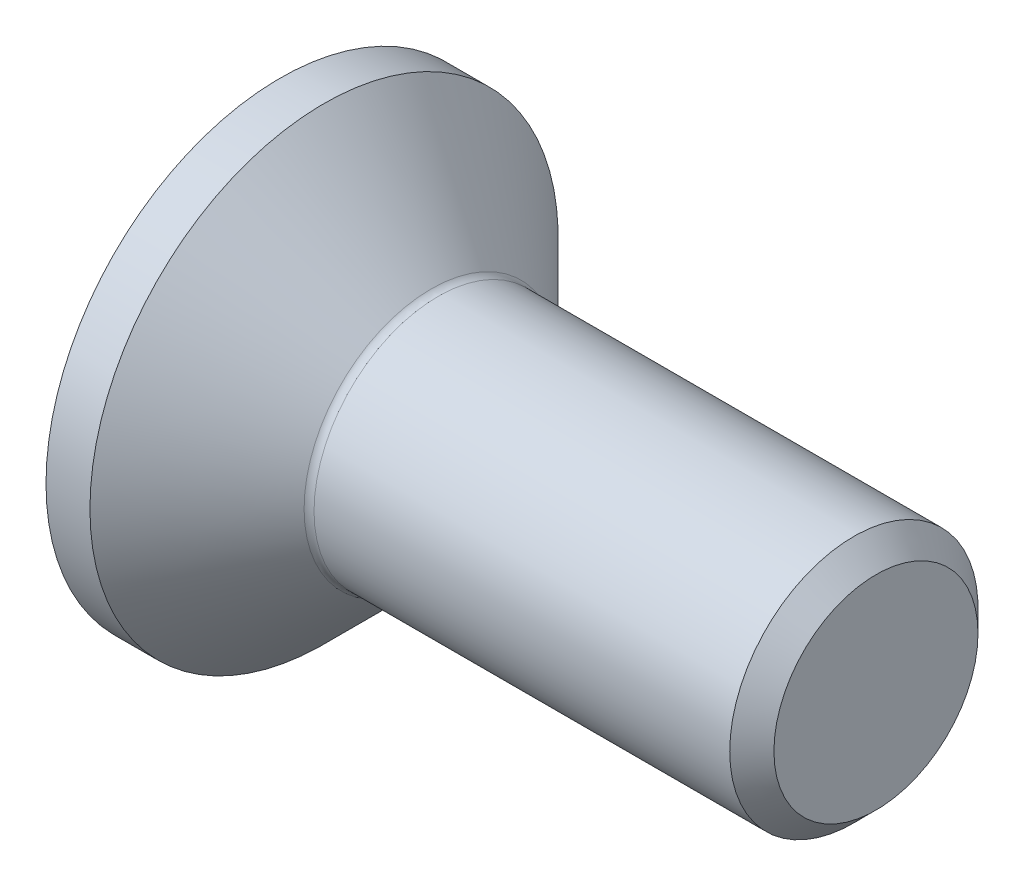
ISO-10303-21;
HEADER;
FILE_DESCRIPTION(('STEP AP214'),'2;1');
FILE_NAME('part.step','',(''),(''),'','','');
FILE_SCHEMA(('AUTOMOTIVE_DESIGN { 1 0 10303 214 1 1 1 1 }'));
ENDSEC;
DATA;
#1=APPLICATION_CONTEXT('core data for automotive mechanical design processes');
#2=APPLICATION_PROTOCOL_DEFINITION('international standard','automotive_design',2000,#1);
#3=PRODUCT_CONTEXT('',#1,'mechanical');
#4=PRODUCT('Part','Part','',(#3));
#5=PRODUCT_RELATED_PRODUCT_CATEGORY('part','',(#4));
#6=PRODUCT_DEFINITION_FORMATION('','',#4);
#7=PRODUCT_DEFINITION_CONTEXT('part definition',#1,'design');
#8=PRODUCT_DEFINITION('design','',#6,#7);
#9=PRODUCT_DEFINITION_SHAPE('','',#8);
#10=(LENGTH_UNIT() NAMED_UNIT(*) SI_UNIT(.MILLI.,.METRE.));
#11=(NAMED_UNIT(*) PLANE_ANGLE_UNIT() SI_UNIT($,.RADIAN.));
#12=(NAMED_UNIT(*) SI_UNIT($,.STERADIAN.) SOLID_ANGLE_UNIT());
#13=UNCERTAINTY_MEASURE_WITH_UNIT(LENGTH_MEASURE(1.E-05),#10,'distance_accuracy_value','');
#14=(GEOMETRIC_REPRESENTATION_CONTEXT(3) GLOBAL_UNCERTAINTY_ASSIGNED_CONTEXT((#13)) GLOBAL_UNIT_ASSIGNED_CONTEXT((#10,
#11,#12)) REPRESENTATION_CONTEXT('',''));
#15=CARTESIAN_POINT('',(0.,0.,0.));
#16=DIRECTION('',(0.,0.,1.));
#17=DIRECTION('',(1.,0.,0.));
#18=AXIS2_PLACEMENT_3D('',#15,#16,#17);
#19=CARTESIAN_POINT('',(0.,0.,0.));
#20=DIRECTION('',(-1.,0.,0.));
#21=DIRECTION('',(0.,0.,1.));
#22=AXIS2_PLACEMENT_3D('',#19,#20,#21);
#23=PLANE('',#22);
#24=CARTESIAN_POINT('',(0.,0.,0.));
#25=DIRECTION('',(-1.,0.,0.));
#26=DIRECTION('',(0.,0.,1.));
#27=AXIS2_PLACEMENT_3D('',#24,#25,#26);
#28=CIRCLE('',#27,4.715);
#29=CARTESIAN_POINT('',(0.,0.,4.715));
#30=VERTEX_POINT('',#29);
#31=EDGE_CURVE('E153',#30,#30,#28,.T.);
#32=ORIENTED_EDGE('',*,*,#31,.T.);
#33=EDGE_LOOP('',(#32));
#34=FACE_BOUND('',#33,.T.);
#35=DIRECTION('',(0.,-0.499999999999999,-0.866025403784439));
#36=VECTOR('',#35,1.);
#37=CARTESIAN_POINT('',(0.,-0.866025403784438,1.5));
#38=LINE('',#37,#36);
#39=CARTESIAN_POINT('',(0.,-0.866025403784438,1.5));
#40=VERTEX_POINT('',#39);
#41=CARTESIAN_POINT('',(0.,-1.73205080756887,0.));
#42=VERTEX_POINT('',#41);
#43=EDGE_CURVE('E119',#40,#42,#38,.T.);
#44=ORIENTED_EDGE('',*,*,#43,.T.);
#45=DIRECTION('',(0.,0.499999999999999,-0.866025403784439));
#46=VECTOR('',#45,1.);
#47=CARTESIAN_POINT('',(0.,-1.73205080756887,0.));
#48=LINE('',#47,#46);
#49=CARTESIAN_POINT('',(0.,-0.866025403784438,-1.5));
#50=VERTEX_POINT('',#49);
#51=EDGE_CURVE('E50',#42,#50,#48,.T.);
#52=ORIENTED_EDGE('',*,*,#51,.T.);
#53=DIRECTION('',(0.,1.,0.));
#54=VECTOR('',#53,1.);
#55=CARTESIAN_POINT('',(0.,-0.866025403784438,-1.5));
#56=LINE('',#55,#54);
#57=CARTESIAN_POINT('',(0.,0.866025403784438,-1.5));
#58=VERTEX_POINT('',#57);
#59=EDGE_CURVE('E130',#50,#58,#56,.T.);
#60=ORIENTED_EDGE('',*,*,#59,.T.);
#61=DIRECTION('',(0.,0.500000000000001,0.866025403784438));
#62=VECTOR('',#61,1.);
#63=CARTESIAN_POINT('',(0.,0.866025403784438,-1.5));
#64=LINE('',#63,#62);
#65=CARTESIAN_POINT('',(0.,1.73205080756888,0.));
#66=VERTEX_POINT('',#65);
#67=EDGE_CURVE('E254',#58,#66,#64,.T.);
#68=ORIENTED_EDGE('',*,*,#67,.T.);
#69=DIRECTION('',(0.,-0.5,0.866025403784438));
#70=VECTOR('',#69,1.);
#71=CARTESIAN_POINT('',(0.,1.73205080756888,0.));
#72=LINE('',#71,#70);
#73=CARTESIAN_POINT('',(0.,0.866025403784438,1.5));
#74=VERTEX_POINT('',#73);
#75=EDGE_CURVE('E257',#66,#74,#72,.T.);
#76=ORIENTED_EDGE('',*,*,#75,.T.);
#77=DIRECTION('',(0.,-1.,0.));
#78=VECTOR('',#77,1.);
#79=CARTESIAN_POINT('',(0.,0.866025403784438,1.5));
#80=LINE('',#79,#78);
#81=EDGE_CURVE('E260',#74,#40,#80,.T.);
#82=ORIENTED_EDGE('',*,*,#81,.T.);
#83=EDGE_LOOP('',(#44,#52,#60,#68,#76,#82));
#84=FACE_BOUND('',#83,.T.);
#85=ADVANCED_FACE('F35',(#34,#84),#23,.T.);
#86=CARTESIAN_POINT('',(0.,0.,0.));
#87=DIRECTION('',(-1.,0.,0.));
#88=DIRECTION('',(0.,0.,1.));
#89=AXIS2_PLACEMENT_3D('',#86,#87,#88);
#90=CYLINDRICAL_SURFACE('',#89,4.715);
#91=CARTESIAN_POINT('',(0.885000000000013,0.,0.));
#92=DIRECTION('',(-1.,0.,0.));
#93=DIRECTION('',(0.,0.,1.));
#94=AXIS2_PLACEMENT_3D('',#91,#92,#93);
#95=CIRCLE('',#94,4.715);
#96=CARTESIAN_POINT('',(0.885000000000013,0.,4.715));
#97=VERTEX_POINT('',#96);
#98=EDGE_CURVE('E150',#97,#97,#95,.T.);
#99=ORIENTED_EDGE('',*,*,#98,.T.);
#100=EDGE_LOOP('',(#99));
#101=FACE_BOUND('',#100,.T.);
#102=ORIENTED_EDGE('',*,*,#31,.F.);
#103=EDGE_LOOP('',(#102));
#104=FACE_BOUND('',#103,.T.);
#105=ADVANCED_FACE('F174',(#101,#104),#90,.T.);
#106=CARTESIAN_POINT('',(0.885000000000013,0.,0.));
#107=DIRECTION('',(-1.,0.,0.));
#108=DIRECTION('',(0.,0.,1.));
#109=AXIS2_PLACEMENT_3D('',#106,#107,#108);
#110=CONICAL_SURFACE('',#109,4.715,0.78539816339745);
#111=CARTESIAN_POINT('',(3.04142135623734,0.,0.));
#112=DIRECTION('',(-1.,0.,0.));
#113=DIRECTION('',(0.,0.,1.));
#114=AXIS2_PLACEMENT_3D('',#111,#112,#113);
#115=CIRCLE('',#114,2.55857864376267);
#116=CARTESIAN_POINT('',(3.04142135623734,0.,2.55857864376267));
#117=VERTEX_POINT('',#116);
#118=EDGE_CURVE('E43',#117,#117,#115,.T.);
#119=ORIENTED_EDGE('',*,*,#118,.T.);
#120=EDGE_LOOP('',(#119));
#121=FACE_BOUND('',#120,.T.);
#122=ORIENTED_EDGE('',*,*,#98,.F.);
#123=EDGE_LOOP('',(#122));
#124=FACE_BOUND('',#123,.T.);
#125=ADVANCED_FACE('F158',(#121,#124),#110,.T.);
#126=CARTESIAN_POINT('',(0.,0.,0.));
#127=DIRECTION('',(-1.,0.,0.));
#128=DIRECTION('',(0.,0.,1.));
#129=AXIS2_PLACEMENT_3D('',#126,#127,#128);
#130=CYLINDRICAL_SURFACE('',#129,2.49999999999998);
#131=CARTESIAN_POINT('',(3.18284271247465,0.,0.));
#132=DIRECTION('',(-1.,0.,0.));
#133=DIRECTION('',(0.,0.,1.));
#134=AXIS2_PLACEMENT_3D('',#131,#132,#133);
#135=CIRCLE('',#134,2.49999999999998);
#136=CARTESIAN_POINT('',(3.18284271247465,0.,2.49999999999998));
#137=VERTEX_POINT('',#136);
#138=EDGE_CURVE('E11',#137,#137,#135,.F.);
#139=ORIENTED_EDGE('',*,*,#138,.T.);
#140=EDGE_LOOP('',(#139));
#141=FACE_BOUND('',#140,.T.);
#142=CARTESIAN_POINT('',(11.555,0.,0.));
#143=DIRECTION('',(-1.,0.,0.));
#144=DIRECTION('',(0.,0.,1.));
#145=AXIS2_PLACEMENT_3D('',#142,#143,#144);
#146=CIRCLE('',#145,2.49999999999996);
#147=CARTESIAN_POINT('',(11.555,0.,2.49999999999996));
#148=VERTEX_POINT('',#147);
#149=EDGE_CURVE('E147',#148,#148,#146,.T.);
#150=ORIENTED_EDGE('',*,*,#149,.T.);
#151=EDGE_LOOP('',(#150));
#152=FACE_BOUND('',#151,.T.);
#153=ADVANCED_FACE('F185',(#141,#152),#130,.T.);
#154=CARTESIAN_POINT('',(12.,0.,0.));
#155=DIRECTION('',(-1.,0.,0.));
#156=DIRECTION('',(0.,0.,1.));
#157=AXIS2_PLACEMENT_3D('',#154,#155,#156);
#158=CONICAL_SURFACE('',#157,2.055,0.785398163397365);
#159=ORIENTED_EDGE('',*,*,#149,.F.);
#160=EDGE_LOOP('',(#159));
#161=FACE_BOUND('',#160,.T.);
#162=CARTESIAN_POINT('',(12.,0.,0.));
#163=DIRECTION('',(-1.,0.,0.));
#164=DIRECTION('',(0.,0.,1.));
#165=AXIS2_PLACEMENT_3D('',#162,#163,#164);
#166=CIRCLE('',#165,2.055);
#167=CARTESIAN_POINT('',(12.,0.,2.055));
#168=VERTEX_POINT('',#167);
#169=EDGE_CURVE('E143',#168,#168,#166,.T.);
#170=ORIENTED_EDGE('',*,*,#169,.T.);
#171=EDGE_LOOP('',(#170));
#172=FACE_BOUND('',#171,.T.);
#173=ADVANCED_FACE('F169',(#161,#172),#158,.T.);
#174=CARTESIAN_POINT('',(12.,2.055,0.));
#175=DIRECTION('',(1.,0.,0.));
#176=DIRECTION('',(0.,0.,-1.));
#177=AXIS2_PLACEMENT_3D('',#174,#175,#176);
#178=PLANE('',#177);
#179=ORIENTED_EDGE('',*,*,#169,.F.);
#180=EDGE_LOOP('',(#179));
#181=FACE_BOUND('',#180,.T.);
#182=ADVANCED_FACE('F162',(#181),#178,.T.);
#183=CARTESIAN_POINT('',(3.18284271247465,0.,0.));
#184=DIRECTION('',(-1.,0.,0.));
#185=DIRECTION('',(0.,0.,1.));
#186=AXIS2_PLACEMENT_3D('',#183,#184,#185);
#187=TOROIDAL_SURFACE('',#186,2.69999999999998,0.2);
#188=ORIENTED_EDGE('',*,*,#138,.F.);
#189=EDGE_LOOP('',(#188));
#190=FACE_BOUND('',#189,.T.);
#191=ORIENTED_EDGE('',*,*,#118,.F.);
#192=EDGE_LOOP('',(#191));
#193=FACE_BOUND('',#192,.T.);
#194=ADVANCED_FACE('F37',(#190,#193),#187,.F.);
#195=CARTESIAN_POINT('',(1.9,-1.73205080756887,0.));
#196=DIRECTION('',(0.,0.866025403784439,0.499999999999999));
#197=DIRECTION('',(0.,-0.499999999999999,0.866025403784439));
#198=AXIS2_PLACEMENT_3D('',#195,#196,#197);
#199=PLANE('',#198);
#200=ORIENTED_EDGE('',*,*,#51,.F.);
#201=DIRECTION('',(-1.,0.,0.));
#202=VECTOR('',#201,1.);
#203=CARTESIAN_POINT('',(1.9,-1.73205080756887,0.));
#204=LINE('',#203,#202);
#205=CARTESIAN_POINT('',(1.9,-1.73205080756887,0.));
#206=VERTEX_POINT('',#205);
#207=EDGE_CURVE('E251',#206,#42,#204,.T.);
#208=ORIENTED_EDGE('',*,*,#207,.F.);
#209=DIRECTION('',(0.,0.499999999999999,-0.866025403784439));
#210=VECTOR('',#209,1.);
#211=CARTESIAN_POINT('',(1.9,-1.73205080756887,0.));
#212=LINE('',#211,#210);
#213=CARTESIAN_POINT('',(1.9,-1.29903810567666,-0.749999999999998));
#214=VERTEX_POINT('',#213);
#215=EDGE_CURVE('E115',#206,#214,#212,.T.);
#216=ORIENTED_EDGE('',*,*,#215,.T.);
#217=CARTESIAN_POINT('',(1.9,-0.866025403784438,-1.5));
#218=VERTEX_POINT('',#217);
#219=EDGE_CURVE('E111',#214,#218,#212,.T.);
#220=ORIENTED_EDGE('',*,*,#219,.T.);
#221=DIRECTION('',(-1.,0.,0.));
#222=VECTOR('',#221,1.);
#223=CARTESIAN_POINT('',(1.9,-0.866025403784438,-1.5));
#224=LINE('',#223,#222);
#225=EDGE_CURVE('E113',#218,#50,#224,.T.);
#226=ORIENTED_EDGE('',*,*,#225,.T.);
#227=EDGE_LOOP('',(#200,#208,#216,#220,#226));
#228=FACE_BOUND('',#227,.T.);
#229=ADVANCED_FACE('F112',(#228),#199,.T.);
#230=CARTESIAN_POINT('',(1.9,-0.866025403784438,-1.5));
#231=DIRECTION('',(0.,0.,1.));
#232=DIRECTION('',(0.,-1.,0.));
#233=AXIS2_PLACEMENT_3D('',#230,#231,#232);
#234=PLANE('',#233);
#235=ORIENTED_EDGE('',*,*,#59,.F.);
#236=ORIENTED_EDGE('',*,*,#225,.F.);
#237=DIRECTION('',(0.,1.,0.));
#238=VECTOR('',#237,1.);
#239=CARTESIAN_POINT('',(1.9,-0.866025403784438,-1.5));
#240=LINE('',#239,#238);
#241=CARTESIAN_POINT('',(1.9,0.,-1.5));
#242=VERTEX_POINT('',#241);
#243=EDGE_CURVE('E58',#218,#242,#240,.T.);
#244=ORIENTED_EDGE('',*,*,#243,.T.);
#245=CARTESIAN_POINT('',(1.9,0.866025403784438,-1.5));
#246=VERTEX_POINT('',#245);
#247=EDGE_CURVE('E125',#242,#246,#240,.T.);
#248=ORIENTED_EDGE('',*,*,#247,.T.);
#249=DIRECTION('',(-1.,0.,0.));
#250=VECTOR('',#249,1.);
#251=CARTESIAN_POINT('',(1.9,0.866025403784438,-1.5));
#252=LINE('',#251,#250);
#253=EDGE_CURVE('E132',#246,#58,#252,.T.);
#254=ORIENTED_EDGE('',*,*,#253,.T.);
#255=EDGE_LOOP('',(#235,#236,#244,#248,#254));
#256=FACE_BOUND('',#255,.T.);
#257=ADVANCED_FACE('F127',(#256),#234,.T.);
#258=CARTESIAN_POINT('',(1.9,0.866025403784438,-1.5));
#259=DIRECTION('',(0.,-0.866025403784438,0.500000000000001));
#260=DIRECTION('',(0.,-0.500000000000001,-0.866025403784438));
#261=AXIS2_PLACEMENT_3D('',#258,#259,#260);
#262=PLANE('',#261);
#263=ORIENTED_EDGE('',*,*,#67,.F.);
#264=ORIENTED_EDGE('',*,*,#253,.F.);
#265=DIRECTION('',(0.,0.500000000000001,0.866025403784438));
#266=VECTOR('',#265,1.);
#267=CARTESIAN_POINT('',(1.9,0.866025403784438,-1.5));
#268=LINE('',#267,#266);
#269=CARTESIAN_POINT('',(1.9,1.29903810567666,-0.750000000000003));
#270=VERTEX_POINT('',#269);
#271=EDGE_CURVE('E232',#246,#270,#268,.T.);
#272=ORIENTED_EDGE('',*,*,#271,.T.);
#273=CARTESIAN_POINT('',(1.9,1.73205080756888,0.));
#274=VERTEX_POINT('',#273);
#275=EDGE_CURVE('E124',#270,#274,#268,.T.);
#276=ORIENTED_EDGE('',*,*,#275,.T.);
#277=DIRECTION('',(-1.,0.,0.));
#278=VECTOR('',#277,1.);
#279=CARTESIAN_POINT('',(1.9,1.73205080756888,0.));
#280=LINE('',#279,#278);
#281=EDGE_CURVE('E138',#274,#66,#280,.T.);
#282=ORIENTED_EDGE('',*,*,#281,.T.);
#283=EDGE_LOOP('',(#263,#264,#272,#276,#282));
#284=FACE_BOUND('',#283,.T.);
#285=ADVANCED_FACE('F199',(#284),#262,.T.);
#286=CARTESIAN_POINT('',(1.9,1.73205080756888,0.));
#287=DIRECTION('',(0.,-0.866025403784439,-0.5));
#288=DIRECTION('',(0.,0.5,-0.866025403784439));
#289=AXIS2_PLACEMENT_3D('',#286,#287,#288);
#290=PLANE('',#289);
#291=ORIENTED_EDGE('',*,*,#75,.F.);
#292=ORIENTED_EDGE('',*,*,#281,.F.);
#293=DIRECTION('',(0.,-0.5,0.866025403784438));
#294=VECTOR('',#293,1.);
#295=CARTESIAN_POINT('',(1.9,1.73205080756888,0.));
#296=LINE('',#295,#294);
#297=CARTESIAN_POINT('',(1.9,1.29903810567666,0.750000000000001));
#298=VERTEX_POINT('',#297);
#299=EDGE_CURVE('E239',#274,#298,#296,.T.);
#300=ORIENTED_EDGE('',*,*,#299,.T.);
#301=CARTESIAN_POINT('',(1.9,0.866025403784438,1.5));
#302=VERTEX_POINT('',#301);
#303=EDGE_CURVE('E237',#298,#302,#296,.T.);
#304=ORIENTED_EDGE('',*,*,#303,.T.);
#305=DIRECTION('',(-1.,0.,0.));
#306=VECTOR('',#305,1.);
#307=CARTESIAN_POINT('',(1.9,0.866025403784438,1.5));
#308=LINE('',#307,#306);
#309=EDGE_CURVE('E269',#302,#74,#308,.T.);
#310=ORIENTED_EDGE('',*,*,#309,.T.);
#311=EDGE_LOOP('',(#291,#292,#300,#304,#310));
#312=FACE_BOUND('',#311,.T.);
#313=ADVANCED_FACE('F202',(#312),#290,.T.);
#314=CARTESIAN_POINT('',(1.9,0.866025403784438,1.5));
#315=DIRECTION('',(0.,0.,-1.));
#316=DIRECTION('',(0.,1.,0.));
#317=AXIS2_PLACEMENT_3D('',#314,#315,#316);
#318=PLANE('',#317);
#319=ORIENTED_EDGE('',*,*,#81,.F.);
#320=ORIENTED_EDGE('',*,*,#309,.F.);
#321=DIRECTION('',(0.,-1.,0.));
#322=VECTOR('',#321,1.);
#323=CARTESIAN_POINT('',(1.9,0.866025403784438,1.5));
#324=LINE('',#323,#322);
#325=CARTESIAN_POINT('',(1.9,0.,1.5));
#326=VERTEX_POINT('',#325);
#327=EDGE_CURVE('E244',#302,#326,#324,.T.);
#328=ORIENTED_EDGE('',*,*,#327,.T.);
#329=CARTESIAN_POINT('',(1.9,-0.866025403784438,1.5));
#330=VERTEX_POINT('',#329);
#331=EDGE_CURVE('E243',#326,#330,#324,.T.);
#332=ORIENTED_EDGE('',*,*,#331,.T.);
#333=DIRECTION('',(-1.,0.,0.));
#334=VECTOR('',#333,1.);
#335=CARTESIAN_POINT('',(1.9,-0.866025403784438,1.5));
#336=LINE('',#335,#334);
#337=EDGE_CURVE('E266',#330,#40,#336,.T.);
#338=ORIENTED_EDGE('',*,*,#337,.T.);
#339=EDGE_LOOP('',(#319,#320,#328,#332,#338));
#340=FACE_BOUND('',#339,.T.);
#341=ADVANCED_FACE('F206',(#340),#318,.T.);
#342=CARTESIAN_POINT('',(1.9,-0.866025403784438,1.5));
#343=DIRECTION('',(0.,0.866025403784439,-0.499999999999999));
#344=DIRECTION('',(0.,0.499999999999999,0.866025403784439));
#345=AXIS2_PLACEMENT_3D('',#342,#343,#344);
#346=PLANE('',#345);
#347=ORIENTED_EDGE('',*,*,#43,.F.);
#348=ORIENTED_EDGE('',*,*,#337,.F.);
#349=DIRECTION('',(0.,-0.499999999999999,-0.866025403784439));
#350=VECTOR('',#349,1.);
#351=CARTESIAN_POINT('',(1.9,-0.866025403784438,1.5));
#352=LINE('',#351,#350);
#353=CARTESIAN_POINT('',(1.9,-1.29903810567666,0.749999999999997));
#354=VERTEX_POINT('',#353);
#355=EDGE_CURVE('E248',#330,#354,#352,.T.);
#356=ORIENTED_EDGE('',*,*,#355,.T.);
#357=EDGE_CURVE('E247',#354,#206,#352,.T.);
#358=ORIENTED_EDGE('',*,*,#357,.T.);
#359=ORIENTED_EDGE('',*,*,#207,.T.);
#360=EDGE_LOOP('',(#347,#348,#356,#358,#359));
#361=FACE_BOUND('',#360,.T.);
#362=ADVANCED_FACE('F210',(#361),#346,.T.);
#363=CARTESIAN_POINT('',(1.9,-0.866025403784437,-1.5));
#364=DIRECTION('',(1.,0.,0.));
#365=DIRECTION('',(0.,0.,-1.));
#366=AXIS2_PLACEMENT_3D('',#363,#364,#365);
#367=PLANE('',#366);
#368=ORIENTED_EDGE('',*,*,#243,.F.);
#369=ORIENTED_EDGE('',*,*,#219,.F.);
#370=CARTESIAN_POINT('',(1.9,0.,0.));
#371=DIRECTION('',(-1.,0.,0.));
#372=DIRECTION('',(0.,0.,1.));
#373=AXIS2_PLACEMENT_3D('',#370,#371,#372);
#374=CIRCLE('',#373,1.5);
#375=EDGE_CURVE('E122',#242,#214,#374,.T.);
#376=ORIENTED_EDGE('',*,*,#375,.F.);
#377=EDGE_LOOP('',(#368,#369,#376));
#378=FACE_BOUND('',#377,.T.);
#379=ADVANCED_FACE('F121',(#378),#367,.F.);
#380=ORIENTED_EDGE('',*,*,#215,.F.);
#381=ORIENTED_EDGE('',*,*,#357,.F.);
#382=EDGE_CURVE('E135',#214,#354,#374,.T.);
#383=ORIENTED_EDGE('',*,*,#382,.F.);
#384=EDGE_LOOP('',(#380,#381,#383));
#385=FACE_BOUND('',#384,.T.);
#386=ADVANCED_FACE('F216',(#385),#367,.F.);
#387=ORIENTED_EDGE('',*,*,#355,.F.);
#388=ORIENTED_EDGE('',*,*,#331,.F.);
#389=EDGE_CURVE('E131',#354,#326,#374,.T.);
#390=ORIENTED_EDGE('',*,*,#389,.F.);
#391=EDGE_LOOP('',(#387,#388,#390));
#392=FACE_BOUND('',#391,.T.);
#393=ADVANCED_FACE('F220',(#392),#367,.F.);
#394=ORIENTED_EDGE('',*,*,#327,.F.);
#395=ORIENTED_EDGE('',*,*,#303,.F.);
#396=EDGE_CURVE('E137',#326,#298,#374,.T.);
#397=ORIENTED_EDGE('',*,*,#396,.F.);
#398=EDGE_LOOP('',(#394,#395,#397));
#399=FACE_BOUND('',#398,.T.);
#400=ADVANCED_FACE('F228',(#399),#367,.F.);
#401=ORIENTED_EDGE('',*,*,#299,.F.);
#402=ORIENTED_EDGE('',*,*,#275,.F.);
#403=EDGE_CURVE('E144',#298,#270,#374,.T.);
#404=ORIENTED_EDGE('',*,*,#403,.F.);
#405=EDGE_LOOP('',(#401,#402,#404));
#406=FACE_BOUND('',#405,.T.);
#407=ADVANCED_FACE('F223',(#406),#367,.F.);
#408=ORIENTED_EDGE('',*,*,#271,.F.);
#409=ORIENTED_EDGE('',*,*,#247,.F.);
#410=EDGE_CURVE('E233',#270,#242,#374,.T.);
#411=ORIENTED_EDGE('',*,*,#410,.F.);
#412=EDGE_LOOP('',(#408,#409,#411));
#413=FACE_BOUND('',#412,.T.);
#414=ADVANCED_FACE('F194',(#413),#367,.F.);
#415=CARTESIAN_POINT('',(1.9,0.,0.));
#416=DIRECTION('',(-1.,0.,0.));
#417=DIRECTION('',(0.,0.,1.));
#418=AXIS2_PLACEMENT_3D('',#415,#416,#417);
#419=CONICAL_SURFACE('',#418,1.5,1.04719755119659);
#420=CARTESIAN_POINT('',(2.76602540378445,0.,0.));
#421=VERTEX_POINT('',#420);
#422=VERTEX_LOOP('',#421);
#423=FACE_BOUND('',#422,.T.);
#424=ORIENTED_EDGE('',*,*,#396,.T.);
#425=ORIENTED_EDGE('',*,*,#403,.T.);
#426=ORIENTED_EDGE('',*,*,#410,.T.);
#427=ORIENTED_EDGE('',*,*,#375,.T.);
#428=ORIENTED_EDGE('',*,*,#382,.T.);
#429=ORIENTED_EDGE('',*,*,#389,.T.);
#430=EDGE_LOOP('',(#424,#425,#426,#427,#428,#429));
#431=FACE_BOUND('',#430,.T.);
#432=ADVANCED_FACE('F192',(#423,#431),#419,.F.);
#433=CLOSED_SHELL('',(#85,#105,#125,#153,#173,#182,#194,#229,#257,#285,#313,#341,#362,#379,#386,
#393,#400,#407,#414,#432));
#434=MANIFOLD_SOLID_BREP('B2',#433);
#435=ADVANCED_BREP_SHAPE_REPRESENTATION('',(#18,#434),#14);
#436=SHAPE_DEFINITION_REPRESENTATION(#9,#435);
ENDSEC;
END-ISO-10303-21;
